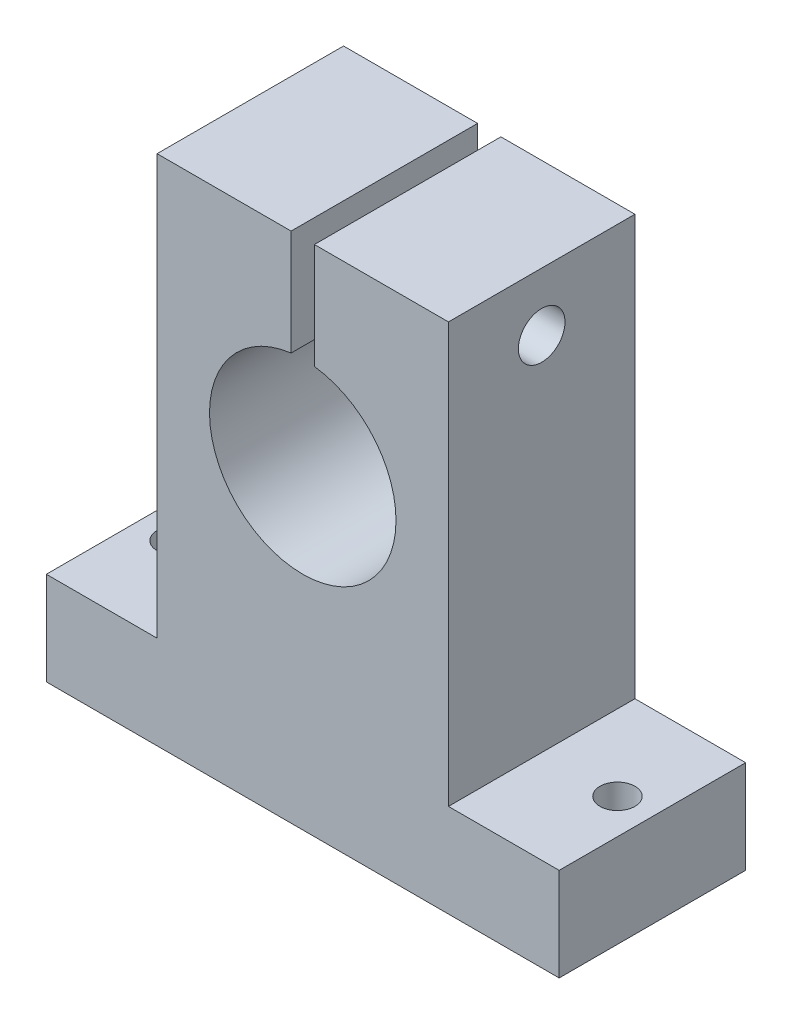
ISO-10303-21;
HEADER;
FILE_DESCRIPTION(('STEP AP214'),'2;1');
FILE_NAME('part.step','',(''),(''),'','','');
FILE_SCHEMA(('AUTOMOTIVE_DESIGN { 1 0 10303 214 1 1 1 1 }'));
ENDSEC;
DATA;
#1=APPLICATION_CONTEXT('core data for automotive mechanical design processes');
#2=APPLICATION_PROTOCOL_DEFINITION('international standard','automotive_design',2000,#1);
#3=PRODUCT_CONTEXT('',#1,'mechanical');
#4=PRODUCT('Part','Part','',(#3));
#5=PRODUCT_RELATED_PRODUCT_CATEGORY('part','',(#4));
#6=PRODUCT_DEFINITION_FORMATION('','',#4);
#7=PRODUCT_DEFINITION_CONTEXT('part definition',#1,'design');
#8=PRODUCT_DEFINITION('design','',#6,#7);
#9=PRODUCT_DEFINITION_SHAPE('','',#8);
#10=(LENGTH_UNIT() NAMED_UNIT(*) SI_UNIT(.MILLI.,.METRE.));
#11=(NAMED_UNIT(*) PLANE_ANGLE_UNIT() SI_UNIT($,.RADIAN.));
#12=(NAMED_UNIT(*) SI_UNIT($,.STERADIAN.) SOLID_ANGLE_UNIT());
#13=UNCERTAINTY_MEASURE_WITH_UNIT(LENGTH_MEASURE(1.E-05),#10,'distance_accuracy_value','');
#14=(GEOMETRIC_REPRESENTATION_CONTEXT(3) GLOBAL_UNCERTAINTY_ASSIGNED_CONTEXT((#13)) GLOBAL_UNIT_ASSIGNED_CONTEXT((#10,
#11,#12)) REPRESENTATION_CONTEXT('',''));
#15=CARTESIAN_POINT('',(0.,0.,0.));
#16=DIRECTION('',(0.,0.,1.));
#17=DIRECTION('',(1.,0.,0.));
#18=AXIS2_PLACEMENT_3D('',#15,#16,#17);
#19=CARTESIAN_POINT('',(9.57834035742499,47.1232940180249,16.));
#20=DIRECTION('',(0.,-1.,0.));
#21=DIRECTION('',(0.,0.,-1.));
#22=AXIS2_PLACEMENT_3D('',#19,#20,#21);
#23=PLANE('',#22);
#24=DIRECTION('',(-1.,0.,0.));
#25=VECTOR('',#24,1.);
#26=CARTESIAN_POINT('',(9.57834035742499,47.1232940180249,16.));
#27=LINE('',#26,#25);
#28=CARTESIAN_POINT('',(-3.92165964257501,47.1232940180249,16.));
#29=VERTEX_POINT('',#28);
#30=CARTESIAN_POINT('',(-15.421659642575,47.1232940180249,16.));
#31=VERTEX_POINT('',#30);
#32=EDGE_CURVE('E148',#29,#31,#27,.T.);
#33=ORIENTED_EDGE('',*,*,#32,.F.);
#34=DIRECTION('',(0.,0.,1.));
#35=VECTOR('',#34,1.);
#36=CARTESIAN_POINT('',(-3.92165964257501,47.1232940180249,0.));
#37=LINE('',#36,#35);
#38=CARTESIAN_POINT('',(-3.92165964257501,47.1232940180249,0.));
#39=VERTEX_POINT('',#38);
#40=EDGE_CURVE('E131',#39,#29,#37,.T.);
#41=ORIENTED_EDGE('',*,*,#40,.F.);
#42=DIRECTION('',(-1.,0.,0.));
#43=VECTOR('',#42,1.);
#44=CARTESIAN_POINT('',(9.57834035742499,47.1232940180249,0.));
#45=LINE('',#44,#43);
#46=CARTESIAN_POINT('',(-15.421659642575,47.1232940180249,0.));
#47=VERTEX_POINT('',#46);
#48=EDGE_CURVE('E169',#39,#47,#45,.T.);
#49=ORIENTED_EDGE('',*,*,#48,.T.);
#50=DIRECTION('',(0.,0.,-1.));
#51=VECTOR('',#50,1.);
#52=CARTESIAN_POINT('',(-15.421659642575,47.1232940180249,16.));
#53=LINE('',#52,#51);
#54=EDGE_CURVE('E181',#31,#47,#53,.T.);
#55=ORIENTED_EDGE('',*,*,#54,.F.);
#56=EDGE_LOOP('',(#33,#41,#49,#55));
#57=FACE_BOUND('',#56,.T.);
#58=ADVANCED_FACE('F35',(#57),#23,.F.);
#59=CARTESIAN_POINT('',(0.,0.,16.));
#60=DIRECTION('',(0.,0.,1.));
#61=DIRECTION('',(1.,0.,0.));
#62=AXIS2_PLACEMENT_3D('',#59,#60,#61);
#63=PLANE('',#62);
#64=DIRECTION('',(0.,1.,0.));
#65=VECTOR('',#64,1.);
#66=CARTESIAN_POINT('',(-3.92165964257501,31.123294018025,16.));
#67=LINE('',#66,#65);
#68=CARTESIAN_POINT('',(-3.92165964257501,38.0605479512187,16.));
#69=VERTEX_POINT('',#68);
#70=EDGE_CURVE('E59',#69,#29,#67,.T.);
#71=ORIENTED_EDGE('',*,*,#70,.T.);
#72=ORIENTED_EDGE('',*,*,#32,.T.);
#73=DIRECTION('',(0.,-1.,0.));
#74=VECTOR('',#73,1.);
#75=CARTESIAN_POINT('',(-15.421659642575,47.1232940180249,16.));
#76=LINE('',#75,#74);
#77=CARTESIAN_POINT('',(-15.421659642575,11.123294018025,16.));
#78=VERTEX_POINT('',#77);
#79=EDGE_CURVE('E147',#31,#78,#76,.T.);
#80=ORIENTED_EDGE('',*,*,#79,.T.);
#81=DIRECTION('',(-1.,0.,0.));
#82=VECTOR('',#81,1.);
#83=CARTESIAN_POINT('',(-15.421659642575,11.123294018025,16.));
#84=LINE('',#83,#82);
#85=CARTESIAN_POINT('',(-24.921659642575,11.123294018025,16.));
#86=VERTEX_POINT('',#85);
#87=EDGE_CURVE('E150',#78,#86,#84,.T.);
#88=ORIENTED_EDGE('',*,*,#87,.T.);
#89=DIRECTION('',(0.,-1.,0.));
#90=VECTOR('',#89,1.);
#91=CARTESIAN_POINT('',(-24.921659642575,11.123294018025,16.));
#92=LINE('',#91,#90);
#93=CARTESIAN_POINT('',(-24.921659642575,3.12329401802496,16.));
#94=VERTEX_POINT('',#93);
#95=EDGE_CURVE('E175',#86,#94,#92,.T.);
#96=ORIENTED_EDGE('',*,*,#95,.T.);
#97=DIRECTION('',(1.,0.,0.));
#98=VECTOR('',#97,1.);
#99=CARTESIAN_POINT('',(-24.921659642575,3.12329401802496,16.));
#100=LINE('',#99,#98);
#101=CARTESIAN_POINT('',(19.078340357425,3.12329401802496,16.));
#102=VERTEX_POINT('',#101);
#103=EDGE_CURVE('E234',#94,#102,#100,.T.);
#104=ORIENTED_EDGE('',*,*,#103,.T.);
#105=DIRECTION('',(0.,1.,0.));
#106=VECTOR('',#105,1.);
#107=CARTESIAN_POINT('',(19.078340357425,3.12329401802496,16.));
#108=LINE('',#107,#106);
#109=CARTESIAN_POINT('',(19.078340357425,11.123294018025,16.));
#110=VERTEX_POINT('',#109);
#111=EDGE_CURVE('E236',#102,#110,#108,.T.);
#112=ORIENTED_EDGE('',*,*,#111,.T.);
#113=DIRECTION('',(-1.,0.,0.));
#114=VECTOR('',#113,1.);
#115=CARTESIAN_POINT('',(19.078340357425,11.123294018025,16.));
#116=LINE('',#115,#114);
#117=CARTESIAN_POINT('',(9.57834035742499,11.123294018025,16.));
#118=VERTEX_POINT('',#117);
#119=EDGE_CURVE('E237',#110,#118,#116,.T.);
#120=ORIENTED_EDGE('',*,*,#119,.T.);
#121=DIRECTION('',(0.,1.,0.));
#122=VECTOR('',#121,1.);
#123=CARTESIAN_POINT('',(9.57834035742499,11.123294018025,16.));
#124=LINE('',#123,#122);
#125=CARTESIAN_POINT('',(9.57834035742499,47.1232940180249,16.));
#126=VERTEX_POINT('',#125);
#127=EDGE_CURVE('E145',#118,#126,#124,.T.);
#128=ORIENTED_EDGE('',*,*,#127,.T.);
#129=CARTESIAN_POINT('',(-1.92165964257501,47.1232940180249,16.));
#130=VERTEX_POINT('',#129);
#131=EDGE_CURVE('E138',#126,#130,#27,.T.);
#132=ORIENTED_EDGE('',*,*,#131,.T.);
#133=DIRECTION('',(0.,1.,0.));
#134=VECTOR('',#133,1.);
#135=CARTESIAN_POINT('',(-1.92165964257501,31.123294018025,16.));
#136=LINE('',#135,#134);
#137=CARTESIAN_POINT('',(-1.92165964257501,38.0605479512187,16.));
#138=VERTEX_POINT('',#137);
#139=EDGE_CURVE('E123',#138,#130,#136,.T.);
#140=ORIENTED_EDGE('',*,*,#139,.F.);
#141=CARTESIAN_POINT('',(-2.92165964257501,30.123294018025,16.));
#142=DIRECTION('',(0.,0.,1.));
#143=DIRECTION('',(1.,0.,0.));
#144=AXIS2_PLACEMENT_3D('',#141,#142,#143);
#145=CIRCLE('',#144,8.);
#146=EDGE_CURVE('E161',#69,#138,#145,.T.);
#147=ORIENTED_EDGE('',*,*,#146,.F.);
#148=EDGE_LOOP('',(#71,#72,#80,#88,#96,#104,#112,#120,#128,#132,#140,#147));
#149=FACE_BOUND('',#148,.T.);
#150=ADVANCED_FACE('F143',(#149),#63,.T.);
#151=CARTESIAN_POINT('',(0.,0.,0.));
#152=DIRECTION('',(0.,0.,1.));
#153=DIRECTION('',(1.,0.,0.));
#154=AXIS2_PLACEMENT_3D('',#151,#152,#153);
#155=PLANE('',#154);
#156=ORIENTED_EDGE('',*,*,#48,.F.);
#157=DIRECTION('',(0.,1.,0.));
#158=VECTOR('',#157,1.);
#159=CARTESIAN_POINT('',(-3.92165964257501,31.123294018025,0.));
#160=LINE('',#159,#158);
#161=CARTESIAN_POINT('',(-3.92165964257501,38.0605479512187,0.));
#162=VERTEX_POINT('',#161);
#163=EDGE_CURVE('E226',#162,#39,#160,.T.);
#164=ORIENTED_EDGE('',*,*,#163,.F.);
#165=CARTESIAN_POINT('',(-2.92165964257501,30.123294018025,0.));
#166=DIRECTION('',(0.,0.,1.));
#167=DIRECTION('',(1.,0.,0.));
#168=AXIS2_PLACEMENT_3D('',#165,#166,#167);
#169=CIRCLE('',#168,8.);
#170=CARTESIAN_POINT('',(-1.92165964257501,38.0605479512187,0.));
#171=VERTEX_POINT('',#170);
#172=EDGE_CURVE('E225',#162,#171,#169,.T.);
#173=ORIENTED_EDGE('',*,*,#172,.T.);
#174=DIRECTION('',(0.,1.,0.));
#175=VECTOR('',#174,1.);
#176=CARTESIAN_POINT('',(-1.92165964257501,31.123294018025,0.));
#177=LINE('',#176,#175);
#178=CARTESIAN_POINT('',(-1.92165964257501,47.1232940180249,0.));
#179=VERTEX_POINT('',#178);
#180=EDGE_CURVE('E52',#171,#179,#177,.T.);
#181=ORIENTED_EDGE('',*,*,#180,.T.);
#182=CARTESIAN_POINT('',(9.57834035742499,47.1232940180249,0.));
#183=VERTEX_POINT('',#182);
#184=EDGE_CURVE('E140',#183,#179,#45,.T.);
#185=ORIENTED_EDGE('',*,*,#184,.F.);
#186=DIRECTION('',(0.,1.,0.));
#187=VECTOR('',#186,1.);
#188=CARTESIAN_POINT('',(9.57834035742499,11.123294018025,0.));
#189=LINE('',#188,#187);
#190=CARTESIAN_POINT('',(9.57834035742499,11.123294018025,0.));
#191=VERTEX_POINT('',#190);
#192=EDGE_CURVE('E167',#191,#183,#189,.T.);
#193=ORIENTED_EDGE('',*,*,#192,.F.);
#194=DIRECTION('',(-1.,0.,0.));
#195=VECTOR('',#194,1.);
#196=CARTESIAN_POINT('',(19.078340357425,11.123294018025,0.));
#197=LINE('',#196,#195);
#198=CARTESIAN_POINT('',(19.078340357425,11.123294018025,0.));
#199=VERTEX_POINT('',#198);
#200=EDGE_CURVE('E165',#199,#191,#197,.T.);
#201=ORIENTED_EDGE('',*,*,#200,.F.);
#202=DIRECTION('',(0.,1.,0.));
#203=VECTOR('',#202,1.);
#204=CARTESIAN_POINT('',(19.078340357425,3.12329401802496,0.));
#205=LINE('',#204,#203);
#206=CARTESIAN_POINT('',(19.078340357425,3.12329401802496,0.));
#207=VERTEX_POINT('',#206);
#208=EDGE_CURVE('E163',#207,#199,#205,.T.);
#209=ORIENTED_EDGE('',*,*,#208,.F.);
#210=DIRECTION('',(1.,0.,0.));
#211=VECTOR('',#210,1.);
#212=CARTESIAN_POINT('',(-24.921659642575,3.12329401802496,0.));
#213=LINE('',#212,#211);
#214=CARTESIAN_POINT('',(-24.921659642575,3.12329401802496,0.));
#215=VERTEX_POINT('',#214);
#216=EDGE_CURVE('E160',#215,#207,#213,.T.);
#217=ORIENTED_EDGE('',*,*,#216,.F.);
#218=DIRECTION('',(0.,-1.,0.));
#219=VECTOR('',#218,1.);
#220=CARTESIAN_POINT('',(-24.921659642575,11.123294018025,0.));
#221=LINE('',#220,#219);
#222=CARTESIAN_POINT('',(-24.921659642575,11.123294018025,0.));
#223=VERTEX_POINT('',#222);
#224=EDGE_CURVE('E157',#223,#215,#221,.T.);
#225=ORIENTED_EDGE('',*,*,#224,.F.);
#226=DIRECTION('',(-1.,0.,0.));
#227=VECTOR('',#226,1.);
#228=CARTESIAN_POINT('',(-15.421659642575,11.123294018025,0.));
#229=LINE('',#228,#227);
#230=CARTESIAN_POINT('',(-15.421659642575,11.123294018025,0.));
#231=VERTEX_POINT('',#230);
#232=EDGE_CURVE('E173',#231,#223,#229,.T.);
#233=ORIENTED_EDGE('',*,*,#232,.F.);
#234=DIRECTION('',(0.,-1.,0.));
#235=VECTOR('',#234,1.);
#236=CARTESIAN_POINT('',(-15.421659642575,47.1232940180249,0.));
#237=LINE('',#236,#235);
#238=EDGE_CURVE('E171',#47,#231,#237,.T.);
#239=ORIENTED_EDGE('',*,*,#238,.F.);
#240=EDGE_LOOP('',(#156,#164,#173,#181,#185,#193,#201,#209,#217,#225,#233,#239));
#241=FACE_BOUND('',#240,.T.);
#242=ADVANCED_FACE('F250',(#241),#155,.F.);
#243=CARTESIAN_POINT('',(-24.921659642575,11.123294018025,16.));
#244=DIRECTION('',(1.,0.,0.));
#245=DIRECTION('',(0.,0.,-1.));
#246=AXIS2_PLACEMENT_3D('',#243,#244,#245);
#247=PLANE('',#246);
#248=ORIENTED_EDGE('',*,*,#224,.T.);
#249=DIRECTION('',(0.,0.,-1.));
#250=VECTOR('',#249,1.);
#251=CARTESIAN_POINT('',(-24.921659642575,3.12329401802496,16.));
#252=LINE('',#251,#250);
#253=EDGE_CURVE('E195',#94,#215,#252,.T.);
#254=ORIENTED_EDGE('',*,*,#253,.F.);
#255=ORIENTED_EDGE('',*,*,#95,.F.);
#256=DIRECTION('',(0.,0.,-1.));
#257=VECTOR('',#256,1.);
#258=CARTESIAN_POINT('',(-24.921659642575,11.123294018025,16.));
#259=LINE('',#258,#257);
#260=EDGE_CURVE('E156',#86,#223,#259,.T.);
#261=ORIENTED_EDGE('',*,*,#260,.T.);
#262=EDGE_LOOP('',(#248,#254,#255,#261));
#263=FACE_BOUND('',#262,.T.);
#264=ADVANCED_FACE('F37',(#263),#247,.F.);
#265=CARTESIAN_POINT('',(-24.921659642575,3.12329401802496,16.));
#266=DIRECTION('',(0.,1.,0.));
#267=DIRECTION('',(0.,0.,1.));
#268=AXIS2_PLACEMENT_3D('',#265,#266,#267);
#269=PLANE('',#268);
#270=CARTESIAN_POINT('',(-21.921659642575,3.12329401802496,8.));
#271=DIRECTION('',(0.,-1.,0.));
#272=DIRECTION('',(0.,0.,-1.));
#273=AXIS2_PLACEMENT_3D('',#270,#271,#272);
#274=CIRCLE('',#273,1.5);
#275=CARTESIAN_POINT('',(-21.921659642575,3.12329401802496,6.5));
#276=VERTEX_POINT('',#275);
#277=EDGE_CURVE('E205',#276,#276,#274,.T.);
#278=ORIENTED_EDGE('',*,*,#277,.F.);
#279=EDGE_LOOP('',(#278));
#280=FACE_BOUND('',#279,.T.);
#281=CARTESIAN_POINT('',(16.078340357425,3.12329401802496,8.));
#282=DIRECTION('',(0.,-1.,0.));
#283=DIRECTION('',(0.,0.,-1.));
#284=AXIS2_PLACEMENT_3D('',#281,#282,#283);
#285=CIRCLE('',#284,1.5);
#286=CARTESIAN_POINT('',(16.078340357425,3.12329401802496,6.5));
#287=VERTEX_POINT('',#286);
#288=EDGE_CURVE('E210',#287,#287,#285,.T.);
#289=ORIENTED_EDGE('',*,*,#288,.F.);
#290=EDGE_LOOP('',(#289));
#291=FACE_BOUND('',#290,.T.);
#292=ORIENTED_EDGE('',*,*,#216,.T.);
#293=DIRECTION('',(0.,0.,-1.));
#294=VECTOR('',#293,1.);
#295=CARTESIAN_POINT('',(19.078340357425,3.12329401802496,16.));
#296=LINE('',#295,#294);
#297=EDGE_CURVE('E192',#102,#207,#296,.T.);
#298=ORIENTED_EDGE('',*,*,#297,.F.);
#299=ORIENTED_EDGE('',*,*,#103,.F.);
#300=ORIENTED_EDGE('',*,*,#253,.T.);
#301=EDGE_LOOP('',(#292,#298,#299,#300));
#302=FACE_BOUND('',#301,.T.);
#303=ADVANCED_FACE('F274',(#280,#291,#302),#269,.F.);
#304=CARTESIAN_POINT('',(19.078340357425,3.12329401802496,16.));
#305=DIRECTION('',(-1.,0.,0.));
#306=DIRECTION('',(0.,0.,1.));
#307=AXIS2_PLACEMENT_3D('',#304,#305,#306);
#308=PLANE('',#307);
#309=ORIENTED_EDGE('',*,*,#208,.T.);
#310=DIRECTION('',(0.,0.,-1.));
#311=VECTOR('',#310,1.);
#312=CARTESIAN_POINT('',(19.078340357425,11.123294018025,16.));
#313=LINE('',#312,#311);
#314=EDGE_CURVE('E189',#110,#199,#313,.T.);
#315=ORIENTED_EDGE('',*,*,#314,.F.);
#316=ORIENTED_EDGE('',*,*,#111,.F.);
#317=ORIENTED_EDGE('',*,*,#297,.T.);
#318=EDGE_LOOP('',(#309,#315,#316,#317));
#319=FACE_BOUND('',#318,.T.);
#320=ADVANCED_FACE('F278',(#319),#308,.F.);
#321=CARTESIAN_POINT('',(19.078340357425,11.123294018025,16.));
#322=DIRECTION('',(0.,-1.,0.));
#323=DIRECTION('',(0.,0.,-1.));
#324=AXIS2_PLACEMENT_3D('',#321,#322,#323);
#325=PLANE('',#324);
#326=CARTESIAN_POINT('',(16.078340357425,11.123294018025,8.));
#327=DIRECTION('',(0.,-1.,0.));
#328=DIRECTION('',(0.,0.,-1.));
#329=AXIS2_PLACEMENT_3D('',#326,#327,#328);
#330=CIRCLE('',#329,1.5);
#331=CARTESIAN_POINT('',(16.078340357425,11.123294018025,6.5));
#332=VERTEX_POINT('',#331);
#333=EDGE_CURVE('E39',#332,#332,#330,.T.);
#334=ORIENTED_EDGE('',*,*,#333,.T.);
#335=EDGE_LOOP('',(#334));
#336=FACE_BOUND('',#335,.T.);
#337=ORIENTED_EDGE('',*,*,#200,.T.);
#338=DIRECTION('',(0.,0.,-1.));
#339=VECTOR('',#338,1.);
#340=CARTESIAN_POINT('',(9.57834035742499,11.123294018025,16.));
#341=LINE('',#340,#339);
#342=EDGE_CURVE('E186',#118,#191,#341,.T.);
#343=ORIENTED_EDGE('',*,*,#342,.F.);
#344=ORIENTED_EDGE('',*,*,#119,.F.);
#345=ORIENTED_EDGE('',*,*,#314,.T.);
#346=EDGE_LOOP('',(#337,#343,#344,#345));
#347=FACE_BOUND('',#346,.T.);
#348=ADVANCED_FACE('F243',(#336,#347),#325,.F.);
#349=CARTESIAN_POINT('',(9.57834035742499,11.123294018025,16.));
#350=DIRECTION('',(-1.,0.,0.));
#351=DIRECTION('',(0.,0.,1.));
#352=AXIS2_PLACEMENT_3D('',#349,#350,#351);
#353=PLANE('',#352);
#354=CARTESIAN_POINT('',(9.57834035742499,42.123294018025,8.));
#355=DIRECTION('',(1.,0.,0.));
#356=DIRECTION('',(0.,0.,-1.));
#357=AXIS2_PLACEMENT_3D('',#354,#355,#356);
#358=CIRCLE('',#357,2.);
#359=CARTESIAN_POINT('',(9.57834035742499,42.123294018025,6.));
#360=VERTEX_POINT('',#359);
#361=EDGE_CURVE('E202',#360,#360,#358,.T.);
#362=ORIENTED_EDGE('',*,*,#361,.F.);
#363=EDGE_LOOP('',(#362));
#364=FACE_BOUND('',#363,.T.);
#365=ORIENTED_EDGE('',*,*,#192,.T.);
#366=DIRECTION('',(0.,0.,-1.));
#367=VECTOR('',#366,1.);
#368=CARTESIAN_POINT('',(9.57834035742499,47.1232940180249,16.));
#369=LINE('',#368,#367);
#370=EDGE_CURVE('E184',#126,#183,#369,.T.);
#371=ORIENTED_EDGE('',*,*,#370,.F.);
#372=ORIENTED_EDGE('',*,*,#127,.F.);
#373=ORIENTED_EDGE('',*,*,#342,.T.);
#374=EDGE_LOOP('',(#365,#371,#372,#373));
#375=FACE_BOUND('',#374,.T.);
#376=ADVANCED_FACE('F247',(#364,#375),#353,.F.);
#377=ORIENTED_EDGE('',*,*,#184,.T.);
#378=DIRECTION('',(0.,0.,-1.));
#379=VECTOR('',#378,1.);
#380=CARTESIAN_POINT('',(-1.92165964257501,47.1232940180249,16.));
#381=LINE('',#380,#379);
#382=EDGE_CURVE('E126',#130,#179,#381,.T.);
#383=ORIENTED_EDGE('',*,*,#382,.F.);
#384=ORIENTED_EDGE('',*,*,#131,.F.);
#385=ORIENTED_EDGE('',*,*,#370,.T.);
#386=EDGE_LOOP('',(#377,#383,#384,#385));
#387=FACE_BOUND('',#386,.T.);
#388=ADVANCED_FACE('F136',(#387),#23,.F.);
#389=CARTESIAN_POINT('',(-15.421659642575,47.1232940180249,16.));
#390=DIRECTION('',(1.,0.,0.));
#391=DIRECTION('',(0.,0.,-1.));
#392=AXIS2_PLACEMENT_3D('',#389,#390,#391);
#393=PLANE('',#392);
#394=CARTESIAN_POINT('',(-15.421659642575,42.123294018025,8.));
#395=DIRECTION('',(1.,0.,0.));
#396=DIRECTION('',(0.,0.,-1.));
#397=AXIS2_PLACEMENT_3D('',#394,#395,#396);
#398=CIRCLE('',#397,2.);
#399=CARTESIAN_POINT('',(-15.421659642575,42.123294018025,6.));
#400=VERTEX_POINT('',#399);
#401=EDGE_CURVE('E141',#400,#400,#398,.T.);
#402=ORIENTED_EDGE('',*,*,#401,.T.);
#403=EDGE_LOOP('',(#402));
#404=FACE_BOUND('',#403,.T.);
#405=ORIENTED_EDGE('',*,*,#238,.T.);
#406=DIRECTION('',(0.,0.,-1.));
#407=VECTOR('',#406,1.);
#408=CARTESIAN_POINT('',(-15.421659642575,11.123294018025,16.));
#409=LINE('',#408,#407);
#410=EDGE_CURVE('E178',#78,#231,#409,.T.);
#411=ORIENTED_EDGE('',*,*,#410,.F.);
#412=ORIENTED_EDGE('',*,*,#79,.F.);
#413=ORIENTED_EDGE('',*,*,#54,.T.);
#414=EDGE_LOOP('',(#405,#411,#412,#413));
#415=FACE_BOUND('',#414,.T.);
#416=ADVANCED_FACE('F263',(#404,#415),#393,.F.);
#417=CARTESIAN_POINT('',(-15.421659642575,11.123294018025,16.));
#418=DIRECTION('',(0.,-1.,0.));
#419=DIRECTION('',(0.,0.,-1.));
#420=AXIS2_PLACEMENT_3D('',#417,#418,#419);
#421=PLANE('',#420);
#422=CARTESIAN_POINT('',(-21.921659642575,11.123294018025,8.));
#423=DIRECTION('',(0.,-1.,0.));
#424=DIRECTION('',(0.,0.,-1.));
#425=AXIS2_PLACEMENT_3D('',#422,#423,#424);
#426=CIRCLE('',#425,1.5);
#427=CARTESIAN_POINT('',(-21.921659642575,11.123294018025,6.5));
#428=VERTEX_POINT('',#427);
#429=EDGE_CURVE('E203',#428,#428,#426,.T.);
#430=ORIENTED_EDGE('',*,*,#429,.T.);
#431=EDGE_LOOP('',(#430));
#432=FACE_BOUND('',#431,.T.);
#433=ORIENTED_EDGE('',*,*,#232,.T.);
#434=ORIENTED_EDGE('',*,*,#260,.F.);
#435=ORIENTED_EDGE('',*,*,#87,.F.);
#436=ORIENTED_EDGE('',*,*,#410,.T.);
#437=EDGE_LOOP('',(#433,#434,#435,#436));
#438=FACE_BOUND('',#437,.T.);
#439=ADVANCED_FACE('F269',(#432,#438),#421,.F.);
#440=CARTESIAN_POINT('',(-2.92165964257501,30.123294018025,16.));
#441=DIRECTION('',(0.,0.,-1.));
#442=DIRECTION('',(-1.,0.,0.));
#443=AXIS2_PLACEMENT_3D('',#440,#441,#442);
#444=CYLINDRICAL_SURFACE('',#443,8.);
#445=DIRECTION('',(0.,0.,-1.));
#446=VECTOR('',#445,1.);
#447=CARTESIAN_POINT('',(-3.92165964257501,38.0605479512187,16.));
#448=LINE('',#447,#446);
#449=EDGE_CURVE('E11',#69,#162,#448,.T.);
#450=ORIENTED_EDGE('',*,*,#449,.F.);
#451=ORIENTED_EDGE('',*,*,#146,.T.);
#452=DIRECTION('',(0.,0.,-1.));
#453=VECTOR('',#452,1.);
#454=CARTESIAN_POINT('',(-1.92165964257501,38.0605479512187,16.));
#455=LINE('',#454,#453);
#456=EDGE_CURVE('E44',#171,#138,#455,.F.);
#457=ORIENTED_EDGE('',*,*,#456,.F.);
#458=ORIENTED_EDGE('',*,*,#172,.F.);
#459=EDGE_LOOP('',(#450,#451,#457,#458));
#460=FACE_BOUND('',#459,.T.);
#461=ADVANCED_FACE('F254',(#460),#444,.F.);
#462=CARTESIAN_POINT('',(-1.92165964257501,31.123294018025,16.));
#463=DIRECTION('',(1.,0.,0.));
#464=DIRECTION('',(0.,0.,-1.));
#465=AXIS2_PLACEMENT_3D('',#462,#463,#464);
#466=PLANE('',#465);
#467=CARTESIAN_POINT('',(-1.92165964257501,42.123294018025,8.));
#468=DIRECTION('',(1.,0.,0.));
#469=DIRECTION('',(0.,0.,-1.));
#470=AXIS2_PLACEMENT_3D('',#467,#468,#469);
#471=CIRCLE('',#470,2.);
#472=CARTESIAN_POINT('',(-1.92165964257501,42.123294018025,6.));
#473=VERTEX_POINT('',#472);
#474=EDGE_CURVE('E201',#473,#473,#471,.T.);
#475=ORIENTED_EDGE('',*,*,#474,.T.);
#476=EDGE_LOOP('',(#475));
#477=FACE_BOUND('',#476,.T.);
#478=ORIENTED_EDGE('',*,*,#456,.T.);
#479=ORIENTED_EDGE('',*,*,#139,.T.);
#480=ORIENTED_EDGE('',*,*,#382,.T.);
#481=ORIENTED_EDGE('',*,*,#180,.F.);
#482=EDGE_LOOP('',(#478,#479,#480,#481));
#483=FACE_BOUND('',#482,.T.);
#484=ADVANCED_FACE('F125',(#477,#483),#466,.F.);
#485=CARTESIAN_POINT('',(-3.92165964257501,31.123294018025,0.));
#486=DIRECTION('',(-1.,0.,0.));
#487=DIRECTION('',(0.,0.,1.));
#488=AXIS2_PLACEMENT_3D('',#485,#486,#487);
#489=PLANE('',#488);
#490=CARTESIAN_POINT('',(-3.92165964257501,42.123294018025,8.));
#491=DIRECTION('',(-1.,0.,0.));
#492=DIRECTION('',(0.,0.,1.));
#493=AXIS2_PLACEMENT_3D('',#490,#491,#492);
#494=CIRCLE('',#493,2.);
#495=CARTESIAN_POINT('',(-3.92165964257501,42.123294018025,10.));
#496=VERTEX_POINT('',#495);
#497=EDGE_CURVE('E199',#496,#496,#494,.T.);
#498=ORIENTED_EDGE('',*,*,#497,.T.);
#499=EDGE_LOOP('',(#498));
#500=FACE_BOUND('',#499,.T.);
#501=ORIENTED_EDGE('',*,*,#449,.T.);
#502=ORIENTED_EDGE('',*,*,#163,.T.);
#503=ORIENTED_EDGE('',*,*,#40,.T.);
#504=ORIENTED_EDGE('',*,*,#70,.F.);
#505=EDGE_LOOP('',(#501,#502,#503,#504));
#506=FACE_BOUND('',#505,.T.);
#507=ADVANCED_FACE('F318',(#500,#506),#489,.F.);
#508=CARTESIAN_POINT('',(-29.421659642575,42.123294018025,8.));
#509=DIRECTION('',(1.,0.,0.));
#510=DIRECTION('',(0.,0.,-1.));
#511=AXIS2_PLACEMENT_3D('',#508,#509,#510);
#512=CYLINDRICAL_SURFACE('',#511,2.);
#513=ORIENTED_EDGE('',*,*,#497,.F.);
#514=EDGE_LOOP('',(#513));
#515=FACE_BOUND('',#514,.T.);
#516=ORIENTED_EDGE('',*,*,#401,.F.);
#517=EDGE_LOOP('',(#516));
#518=FACE_BOUND('',#517,.T.);
#519=ADVANCED_FACE('F313',(#515,#518),#512,.F.);
#520=ORIENTED_EDGE('',*,*,#361,.T.);
#521=EDGE_LOOP('',(#520));
#522=FACE_BOUND('',#521,.T.);
#523=ORIENTED_EDGE('',*,*,#474,.F.);
#524=EDGE_LOOP('',(#523));
#525=FACE_BOUND('',#524,.T.);
#526=ADVANCED_FACE('F309',(#522,#525),#512,.F.);
#527=CARTESIAN_POINT('',(-21.921659642575,42.123294018025,8.));
#528=DIRECTION('',(0.,-1.,0.));
#529=DIRECTION('',(0.,0.,-1.));
#530=AXIS2_PLACEMENT_3D('',#527,#528,#529);
#531=CYLINDRICAL_SURFACE('',#530,1.5);
#532=ORIENTED_EDGE('',*,*,#277,.T.);
#533=EDGE_LOOP('',(#532));
#534=FACE_BOUND('',#533,.T.);
#535=ORIENTED_EDGE('',*,*,#429,.F.);
#536=EDGE_LOOP('',(#535));
#537=FACE_BOUND('',#536,.T.);
#538=ADVANCED_FACE('F312',(#534,#537),#531,.F.);
#539=CARTESIAN_POINT('',(16.078340357425,42.123294018025,8.));
#540=DIRECTION('',(0.,-1.,0.));
#541=DIRECTION('',(0.,0.,-1.));
#542=AXIS2_PLACEMENT_3D('',#539,#540,#541);
#543=CYLINDRICAL_SURFACE('',#542,1.5);
#544=ORIENTED_EDGE('',*,*,#288,.T.);
#545=EDGE_LOOP('',(#544));
#546=FACE_BOUND('',#545,.T.);
#547=ORIENTED_EDGE('',*,*,#333,.F.);
#548=EDGE_LOOP('',(#547));
#549=FACE_BOUND('',#548,.T.);
#550=ADVANCED_FACE('F341',(#546,#549),#543,.F.);
#551=CLOSED_SHELL('',(#58,#150,#242,#264,#303,#320,#348,#376,#388,#416,#439,#461,#484,#507,#519,
#526,#538,#550));
#552=MANIFOLD_SOLID_BREP('B2',#551);
#553=ADVANCED_BREP_SHAPE_REPRESENTATION('',(#18,#552),#14);
#554=SHAPE_DEFINITION_REPRESENTATION(#9,#553);
ENDSEC;
END-ISO-10303-21;
